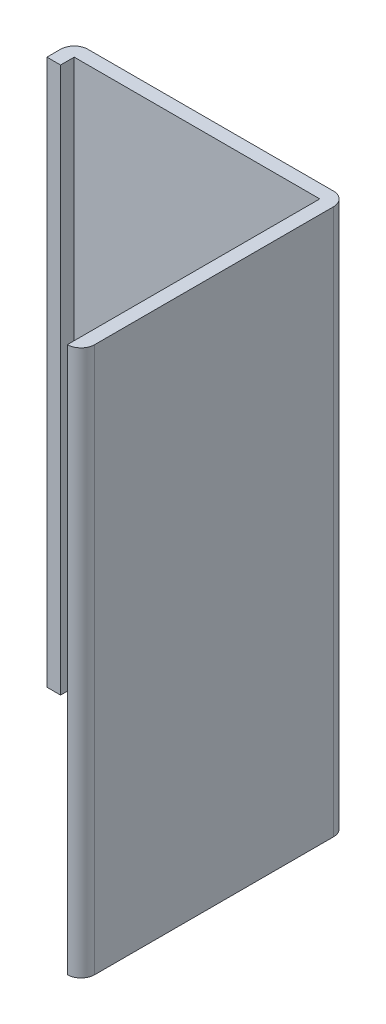
ISO-10303-21;
HEADER;
FILE_DESCRIPTION(('STEP AP214'),'2;1');
FILE_NAME('part.step','',(''),(''),'','','');
FILE_SCHEMA(('AUTOMOTIVE_DESIGN { 1 0 10303 214 1 1 1 1 }'));
ENDSEC;
DATA;
#1=APPLICATION_CONTEXT('core data for automotive mechanical design processes');
#2=APPLICATION_PROTOCOL_DEFINITION('international standard','automotive_design',2000,#1);
#3=PRODUCT_CONTEXT('',#1,'mechanical');
#4=PRODUCT('Part','Part','',(#3));
#5=PRODUCT_RELATED_PRODUCT_CATEGORY('part','',(#4));
#6=PRODUCT_DEFINITION_FORMATION('','',#4);
#7=PRODUCT_DEFINITION_CONTEXT('part definition',#1,'design');
#8=PRODUCT_DEFINITION('design','',#6,#7);
#9=PRODUCT_DEFINITION_SHAPE('','',#8);
#10=(LENGTH_UNIT() NAMED_UNIT(*) SI_UNIT(.MILLI.,.METRE.));
#11=(NAMED_UNIT(*) PLANE_ANGLE_UNIT() SI_UNIT($,.RADIAN.));
#12=(NAMED_UNIT(*) SI_UNIT($,.STERADIAN.) SOLID_ANGLE_UNIT());
#13=UNCERTAINTY_MEASURE_WITH_UNIT(LENGTH_MEASURE(1.E-05),#10,'distance_accuracy_value','');
#14=(GEOMETRIC_REPRESENTATION_CONTEXT(3) GLOBAL_UNCERTAINTY_ASSIGNED_CONTEXT((#13)) GLOBAL_UNIT_ASSIGNED_CONTEXT((#10,
#11,#12)) REPRESENTATION_CONTEXT('',''));
#15=CARTESIAN_POINT('',(0.,0.,0.));
#16=DIRECTION('',(0.,0.,1.));
#17=DIRECTION('',(1.,0.,0.));
#18=AXIS2_PLACEMENT_3D('',#15,#16,#17);
#19=CARTESIAN_POINT('',(1.7526,-0.508,0.0254));
#20=DIRECTION('',(0.,0.,-1.));
#21=DIRECTION('',(-1.,0.,0.));
#22=AXIS2_PLACEMENT_3D('',#19,#20,#21);
#23=PLANE('',#22);
#24=DIRECTION('',(0.,1.,0.));
#25=VECTOR('',#24,1.);
#26=CARTESIAN_POINT('',(2.2098,-0.508,0.0254));
#27=LINE('',#26,#25);
#28=CARTESIAN_POINT('',(2.2098,-0.508,0.0254));
#29=VERTEX_POINT('',#28);
#30=CARTESIAN_POINT('',(2.2098,0.508,0.0254));
#31=VERTEX_POINT('',#30);
#32=EDGE_CURVE('E124',#29,#31,#27,.T.);
#33=ORIENTED_EDGE('',*,*,#32,.T.);
#34=DIRECTION('',(1.,0.,0.));
#35=VECTOR('',#34,1.);
#36=CARTESIAN_POINT('',(2.2098,0.508,0.0254));
#37=LINE('',#36,#35);
#38=CARTESIAN_POINT('',(1.7526,0.508,0.0254));
#39=VERTEX_POINT('',#38);
#40=EDGE_CURVE('E111',#31,#39,#37,.F.);
#41=ORIENTED_EDGE('',*,*,#40,.T.);
#42=DIRECTION('',(0.,1.,0.));
#43=VECTOR('',#42,1.);
#44=CARTESIAN_POINT('',(1.7526,-0.508,0.0254));
#45=LINE('',#44,#43);
#46=CARTESIAN_POINT('',(1.7526,-0.508,0.0254));
#47=VERTEX_POINT('',#46);
#48=EDGE_CURVE('E107',#39,#47,#45,.F.);
#49=ORIENTED_EDGE('',*,*,#48,.T.);
#50=DIRECTION('',(1.,0.,0.));
#51=VECTOR('',#50,1.);
#52=CARTESIAN_POINT('',(2.2098,-0.508,0.0254));
#53=LINE('',#52,#51);
#54=EDGE_CURVE('E125',#29,#47,#53,.F.);
#55=ORIENTED_EDGE('',*,*,#54,.F.);
#56=EDGE_LOOP('',(#33,#41,#49,#55));
#57=FACE_BOUND('',#56,.T.);
#58=ADVANCED_FACE('F16',(#57),#23,.F.);
#59=CARTESIAN_POINT('',(1.7526,-0.508,0.0508));
#60=DIRECTION('',(-1.,0.,0.));
#61=DIRECTION('',(0.,0.,1.));
#62=AXIS2_PLACEMENT_3D('',#59,#60,#61);
#63=PLANE('',#62);
#64=ORIENTED_EDGE('',*,*,#48,.F.);
#65=DIRECTION('',(0.,0.,-1.));
#66=VECTOR('',#65,1.);
#67=CARTESIAN_POINT('',(1.7526,0.508,0.0254));
#68=LINE('',#67,#66);
#69=CARTESIAN_POINT('',(1.7526,0.508,0.0508));
#70=VERTEX_POINT('',#69);
#71=EDGE_CURVE('E119',#39,#70,#68,.F.);
#72=ORIENTED_EDGE('',*,*,#71,.T.);
#73=DIRECTION('',(0.,1.,0.));
#74=VECTOR('',#73,1.);
#75=CARTESIAN_POINT('',(1.7526,-0.508,0.0508));
#76=LINE('',#75,#74);
#77=CARTESIAN_POINT('',(1.7526,-0.508,0.0508));
#78=VERTEX_POINT('',#77);
#79=EDGE_CURVE('E176',#70,#78,#76,.F.);
#80=ORIENTED_EDGE('',*,*,#79,.T.);
#81=DIRECTION('',(0.,0.,-1.));
#82=VECTOR('',#81,1.);
#83=CARTESIAN_POINT('',(1.7526,-0.508,0.0254));
#84=LINE('',#83,#82);
#85=EDGE_CURVE('E167',#47,#78,#84,.F.);
#86=ORIENTED_EDGE('',*,*,#85,.F.);
#87=EDGE_LOOP('',(#64,#72,#80,#86));
#88=FACE_BOUND('',#87,.T.);
#89=ADVANCED_FACE('F226',(#88),#63,.F.);
#90=CARTESIAN_POINT('',(1.7272,-0.508,0.0508));
#91=DIRECTION('',(0.,0.,-1.));
#92=DIRECTION('',(-1.,0.,0.));
#93=AXIS2_PLACEMENT_3D('',#90,#91,#92);
#94=PLANE('',#93);
#95=ORIENTED_EDGE('',*,*,#79,.F.);
#96=DIRECTION('',(1.,0.,0.));
#97=VECTOR('',#96,1.);
#98=CARTESIAN_POINT('',(2.2098,0.508,0.0508));
#99=LINE('',#98,#97);
#100=CARTESIAN_POINT('',(1.7272,0.508,0.0508));
#101=VERTEX_POINT('',#100);
#102=EDGE_CURVE('E144',#70,#101,#99,.F.);
#103=ORIENTED_EDGE('',*,*,#102,.T.);
#104=DIRECTION('',(0.,1.,0.));
#105=VECTOR('',#104,1.);
#106=CARTESIAN_POINT('',(1.7272,-0.508,0.0508));
#107=LINE('',#106,#105);
#108=CARTESIAN_POINT('',(1.7272,-0.508,0.0508));
#109=VERTEX_POINT('',#108);
#110=EDGE_CURVE('E183',#101,#109,#107,.F.);
#111=ORIENTED_EDGE('',*,*,#110,.T.);
#112=DIRECTION('',(1.,0.,0.));
#113=VECTOR('',#112,1.);
#114=CARTESIAN_POINT('',(2.2098,-0.508,0.0508));
#115=LINE('',#114,#113);
#116=EDGE_CURVE('E85',#78,#109,#115,.F.);
#117=ORIENTED_EDGE('',*,*,#116,.F.);
#118=EDGE_LOOP('',(#95,#103,#111,#117));
#119=FACE_BOUND('',#118,.T.);
#120=ADVANCED_FACE('F225',(#119),#94,.F.);
#121=CARTESIAN_POINT('',(1.7272,-0.508,0.0254));
#122=DIRECTION('',(1.,0.,0.));
#123=DIRECTION('',(0.,0.,-1.));
#124=AXIS2_PLACEMENT_3D('',#121,#122,#123);
#125=PLANE('',#124);
#126=ORIENTED_EDGE('',*,*,#110,.F.);
#127=DIRECTION('',(0.,0.,-1.));
#128=VECTOR('',#127,1.);
#129=CARTESIAN_POINT('',(1.7272,0.508,0.0254));
#130=LINE('',#129,#128);
#131=CARTESIAN_POINT('',(1.7272,0.508,0.0254));
#132=VERTEX_POINT('',#131);
#133=EDGE_CURVE('E147',#101,#132,#130,.T.);
#134=ORIENTED_EDGE('',*,*,#133,.T.);
#135=DIRECTION('',(0.,-1.,0.));
#136=VECTOR('',#135,1.);
#137=CARTESIAN_POINT('',(1.7272,-0.508,0.0254));
#138=LINE('',#137,#136);
#139=CARTESIAN_POINT('',(1.7272,-0.508,0.0254));
#140=VERTEX_POINT('',#139);
#141=EDGE_CURVE('E133',#140,#132,#138,.F.);
#142=ORIENTED_EDGE('',*,*,#141,.F.);
#143=DIRECTION('',(0.,0.,-1.));
#144=VECTOR('',#143,1.);
#145=CARTESIAN_POINT('',(1.7272,-0.508,0.0254));
#146=LINE('',#145,#144);
#147=EDGE_CURVE('E79',#109,#140,#146,.T.);
#148=ORIENTED_EDGE('',*,*,#147,.F.);
#149=EDGE_LOOP('',(#126,#134,#142,#148));
#150=FACE_BOUND('',#149,.T.);
#151=ADVANCED_FACE('F223',(#150),#125,.F.);
#152=CARTESIAN_POINT('',(2.2352,-0.508,0.4699));
#153=DIRECTION('',(-1.,0.,0.));
#154=DIRECTION('',(0.,0.,1.));
#155=AXIS2_PLACEMENT_3D('',#152,#153,#154);
#156=PLANE('',#155);
#157=DIRECTION('',(0.,-1.,0.));
#158=VECTOR('',#157,1.);
#159=CARTESIAN_POINT('',(2.2352,-0.508,0.0254));
#160=LINE('',#159,#158);
#161=CARTESIAN_POINT('',(2.2352,0.508,0.0254));
#162=VERTEX_POINT('',#161);
#163=CARTESIAN_POINT('',(2.2352,-0.508,0.0254));
#164=VERTEX_POINT('',#163);
#165=EDGE_CURVE('E73',#162,#164,#160,.T.);
#166=ORIENTED_EDGE('',*,*,#165,.F.);
#167=DIRECTION('',(0.,0.,-1.));
#168=VECTOR('',#167,1.);
#169=CARTESIAN_POINT('',(2.2352,0.508,0.0254));
#170=LINE('',#169,#168);
#171=CARTESIAN_POINT('',(2.2352,0.508,0.4699));
#172=VERTEX_POINT('',#171);
#173=EDGE_CURVE('E138',#162,#172,#170,.F.);
#174=ORIENTED_EDGE('',*,*,#173,.T.);
#175=DIRECTION('',(0.,-1.,0.));
#176=VECTOR('',#175,1.);
#177=CARTESIAN_POINT('',(2.2352,-0.508,0.4699));
#178=LINE('',#177,#176);
#179=CARTESIAN_POINT('',(2.2352,-0.508,0.4699));
#180=VERTEX_POINT('',#179);
#181=EDGE_CURVE('E189',#180,#172,#178,.F.);
#182=ORIENTED_EDGE('',*,*,#181,.F.);
#183=DIRECTION('',(0.,0.,-1.));
#184=VECTOR('',#183,1.);
#185=CARTESIAN_POINT('',(2.2352,-0.508,0.0254));
#186=LINE('',#185,#184);
#187=EDGE_CURVE('E159',#164,#180,#186,.F.);
#188=ORIENTED_EDGE('',*,*,#187,.F.);
#189=EDGE_LOOP('',(#166,#174,#182,#188));
#190=FACE_BOUND('',#189,.T.);
#191=ADVANCED_FACE('F215',(#190),#156,.F.);
#192=CARTESIAN_POINT('',(2.2098,-0.508,0.4699));
#193=DIRECTION('',(0.,-1.,0.));
#194=DIRECTION('',(0.,0.,-1.));
#195=AXIS2_PLACEMENT_3D('',#192,#193,#194);
#196=CYLINDRICAL_SURFACE('',#195,0.0254);
#197=CARTESIAN_POINT('',(2.2098,0.508,0.4699));
#198=DIRECTION('',(0.,-1.,0.));
#199=DIRECTION('',(0.,0.,-1.));
#200=AXIS2_PLACEMENT_3D('',#197,#198,#199);
#201=CIRCLE('',#200,0.0254);
#202=CARTESIAN_POINT('',(2.2098,0.508,0.4953));
#203=VERTEX_POINT('',#202);
#204=EDGE_CURVE('E134',#172,#203,#201,.T.);
#205=ORIENTED_EDGE('',*,*,#204,.T.);
#206=DIRECTION('',(0.,1.,0.));
#207=VECTOR('',#206,1.);
#208=CARTESIAN_POINT('',(2.2098,-0.508,0.4953));
#209=LINE('',#208,#207);
#210=CARTESIAN_POINT('',(2.2098,-0.508,0.4953));
#211=VERTEX_POINT('',#210);
#212=EDGE_CURVE('E128',#203,#211,#209,.F.);
#213=ORIENTED_EDGE('',*,*,#212,.T.);
#214=CARTESIAN_POINT('',(2.2098,-0.508,0.4699));
#215=DIRECTION('',(0.,-1.,0.));
#216=DIRECTION('',(0.,0.,-1.));
#217=AXIS2_PLACEMENT_3D('',#214,#215,#216);
#218=CIRCLE('',#217,0.0254);
#219=EDGE_CURVE('E155',#180,#211,#218,.T.);
#220=ORIENTED_EDGE('',*,*,#219,.F.);
#221=ORIENTED_EDGE('',*,*,#181,.T.);
#222=EDGE_LOOP('',(#205,#213,#220,#221));
#223=FACE_BOUND('',#222,.T.);
#224=ADVANCED_FACE('F217',(#223),#196,.T.);
#225=CARTESIAN_POINT('',(2.2098,-0.508,0.0254));
#226=DIRECTION('',(1.,0.,0.));
#227=DIRECTION('',(0.,0.,-1.));
#228=AXIS2_PLACEMENT_3D('',#225,#226,#227);
#229=PLANE('',#228);
#230=DIRECTION('',(0.,0.,-1.));
#231=VECTOR('',#230,1.);
#232=CARTESIAN_POINT('',(2.2098,-0.508,0.0254));
#233=LINE('',#232,#231);
#234=EDGE_CURVE('E158',#211,#29,#233,.T.);
#235=ORIENTED_EDGE('',*,*,#234,.F.);
#236=ORIENTED_EDGE('',*,*,#212,.F.);
#237=DIRECTION('',(0.,0.,-1.));
#238=VECTOR('',#237,1.);
#239=CARTESIAN_POINT('',(2.2098,0.508,0.0254));
#240=LINE('',#239,#238);
#241=EDGE_CURVE('E116',#203,#31,#240,.T.);
#242=ORIENTED_EDGE('',*,*,#241,.T.);
#243=ORIENTED_EDGE('',*,*,#32,.F.);
#244=EDGE_LOOP('',(#235,#236,#242,#243));
#245=FACE_BOUND('',#244,.T.);
#246=ADVANCED_FACE('F130',(#245),#229,.F.);
#247=CARTESIAN_POINT('',(2.2098,-0.508,0.0254));
#248=DIRECTION('',(0.,-1.,0.));
#249=DIRECTION('',(0.,0.,-1.));
#250=AXIS2_PLACEMENT_3D('',#247,#248,#249);
#251=CYLINDRICAL_SURFACE('',#250,0.0254);
#252=CARTESIAN_POINT('',(2.2098,0.508,0.0254));
#253=DIRECTION('',(0.,-1.,0.));
#254=DIRECTION('',(0.,0.,-1.));
#255=AXIS2_PLACEMENT_3D('',#252,#253,#254);
#256=CIRCLE('',#255,0.0254);
#257=CARTESIAN_POINT('',(2.2098,0.508,0.));
#258=VERTEX_POINT('',#257);
#259=EDGE_CURVE('E19',#258,#162,#256,.T.);
#260=ORIENTED_EDGE('',*,*,#259,.T.);
#261=ORIENTED_EDGE('',*,*,#165,.T.);
#262=CARTESIAN_POINT('',(2.2098,-0.508,0.0254));
#263=DIRECTION('',(0.,-1.,0.));
#264=DIRECTION('',(0.,0.,-1.));
#265=AXIS2_PLACEMENT_3D('',#262,#263,#264);
#266=CIRCLE('',#265,0.0254);
#267=CARTESIAN_POINT('',(2.2098,-0.508,0.));
#268=VERTEX_POINT('',#267);
#269=EDGE_CURVE('E160',#268,#164,#266,.T.);
#270=ORIENTED_EDGE('',*,*,#269,.F.);
#271=DIRECTION('',(0.,1.,0.));
#272=VECTOR('',#271,1.);
#273=CARTESIAN_POINT('',(2.2098,-0.508,0.));
#274=LINE('',#273,#272);
#275=EDGE_CURVE('E63',#268,#258,#274,.T.);
#276=ORIENTED_EDGE('',*,*,#275,.T.);
#277=EDGE_LOOP('',(#260,#261,#270,#276));
#278=FACE_BOUND('',#277,.T.);
#279=ADVANCED_FACE('F218',(#278),#251,.T.);
#280=CARTESIAN_POINT('',(2.2098,0.508,0.0254));
#281=DIRECTION('',(0.,-1.,0.));
#282=DIRECTION('',(0.,0.,-1.));
#283=AXIS2_PLACEMENT_3D('',#280,#281,#282);
#284=PLANE('',#283);
#285=ORIENTED_EDGE('',*,*,#241,.F.);
#286=ORIENTED_EDGE('',*,*,#204,.F.);
#287=ORIENTED_EDGE('',*,*,#173,.F.);
#288=ORIENTED_EDGE('',*,*,#259,.F.);
#289=DIRECTION('',(1.,0.,0.));
#290=VECTOR('',#289,1.);
#291=CARTESIAN_POINT('',(2.2098,0.508,0.));
#292=LINE('',#291,#290);
#293=CARTESIAN_POINT('',(1.7526,0.508,0.));
#294=VERTEX_POINT('',#293);
#295=EDGE_CURVE('E203',#258,#294,#292,.F.);
#296=ORIENTED_EDGE('',*,*,#295,.T.);
#297=CARTESIAN_POINT('',(1.7526,0.508,0.0254));
#298=DIRECTION('',(0.,-1.,0.));
#299=DIRECTION('',(0.,0.,-1.));
#300=AXIS2_PLACEMENT_3D('',#297,#298,#299);
#301=CIRCLE('',#300,0.0254);
#302=EDGE_CURVE('E136',#132,#294,#301,.T.);
#303=ORIENTED_EDGE('',*,*,#302,.F.);
#304=ORIENTED_EDGE('',*,*,#133,.F.);
#305=ORIENTED_EDGE('',*,*,#102,.F.);
#306=ORIENTED_EDGE('',*,*,#71,.F.);
#307=ORIENTED_EDGE('',*,*,#40,.F.);
#308=EDGE_LOOP('',(#285,#286,#287,#288,#296,#303,#304,#305,#306,#307));
#309=FACE_BOUND('',#308,.T.);
#310=ADVANCED_FACE('F113',(#309),#284,.F.);
#311=CARTESIAN_POINT('',(1.7526,-0.508,0.0254));
#312=DIRECTION('',(0.,-1.,0.));
#313=DIRECTION('',(0.,0.,-1.));
#314=AXIS2_PLACEMENT_3D('',#311,#312,#313);
#315=CYLINDRICAL_SURFACE('',#314,0.0254);
#316=ORIENTED_EDGE('',*,*,#302,.T.);
#317=DIRECTION('',(0.,1.,0.));
#318=VECTOR('',#317,1.);
#319=CARTESIAN_POINT('',(1.7526,-0.508,0.));
#320=LINE('',#319,#318);
#321=CARTESIAN_POINT('',(1.7526,-0.508,0.));
#322=VERTEX_POINT('',#321);
#323=EDGE_CURVE('E25',#294,#322,#320,.F.);
#324=ORIENTED_EDGE('',*,*,#323,.T.);
#325=CARTESIAN_POINT('',(1.7526,-0.508,0.0254));
#326=DIRECTION('',(0.,-1.,0.));
#327=DIRECTION('',(0.,0.,-1.));
#328=AXIS2_PLACEMENT_3D('',#325,#326,#327);
#329=CIRCLE('',#328,0.0254);
#330=EDGE_CURVE('E33',#140,#322,#329,.T.);
#331=ORIENTED_EDGE('',*,*,#330,.F.);
#332=ORIENTED_EDGE('',*,*,#141,.T.);
#333=EDGE_LOOP('',(#316,#324,#331,#332));
#334=FACE_BOUND('',#333,.T.);
#335=ADVANCED_FACE('F220',(#334),#315,.T.);
#336=CARTESIAN_POINT('',(2.2098,-0.508,0.0254));
#337=DIRECTION('',(0.,-1.,0.));
#338=DIRECTION('',(0.,0.,-1.));
#339=AXIS2_PLACEMENT_3D('',#336,#337,#338);
#340=PLANE('',#339);
#341=ORIENTED_EDGE('',*,*,#219,.T.);
#342=ORIENTED_EDGE('',*,*,#234,.T.);
#343=ORIENTED_EDGE('',*,*,#54,.T.);
#344=ORIENTED_EDGE('',*,*,#85,.T.);
#345=ORIENTED_EDGE('',*,*,#116,.T.);
#346=ORIENTED_EDGE('',*,*,#147,.T.);
#347=ORIENTED_EDGE('',*,*,#330,.T.);
#348=DIRECTION('',(1.,0.,0.));
#349=VECTOR('',#348,1.);
#350=CARTESIAN_POINT('',(2.2098,-0.508,0.));
#351=LINE('',#350,#349);
#352=EDGE_CURVE('E11',#322,#268,#351,.T.);
#353=ORIENTED_EDGE('',*,*,#352,.T.);
#354=ORIENTED_EDGE('',*,*,#269,.T.);
#355=ORIENTED_EDGE('',*,*,#187,.T.);
#356=EDGE_LOOP('',(#341,#342,#343,#344,#345,#346,#347,#353,#354,#355));
#357=FACE_BOUND('',#356,.T.);
#358=ADVANCED_FACE('F212',(#357),#340,.T.);
#359=CARTESIAN_POINT('',(2.2098,-0.508,0.));
#360=DIRECTION('',(0.,0.,1.));
#361=DIRECTION('',(1.,0.,0.));
#362=AXIS2_PLACEMENT_3D('',#359,#360,#361);
#363=PLANE('',#362);
#364=ORIENTED_EDGE('',*,*,#323,.F.);
#365=ORIENTED_EDGE('',*,*,#295,.F.);
#366=ORIENTED_EDGE('',*,*,#275,.F.);
#367=ORIENTED_EDGE('',*,*,#352,.F.);
#368=EDGE_LOOP('',(#364,#365,#366,#367));
#369=FACE_BOUND('',#368,.T.);
#370=ADVANCED_FACE('F219',(#369),#363,.F.);
#371=CLOSED_SHELL('',(#58,#89,#120,#151,#191,#224,#246,#279,#310,#335,#358,#370));
#372=MANIFOLD_SOLID_BREP('B1',#371);
#373=ADVANCED_BREP_SHAPE_REPRESENTATION('',(#18,#372),#14);
#374=SHAPE_DEFINITION_REPRESENTATION(#9,#373);
ENDSEC;
END-ISO-10303-21;
